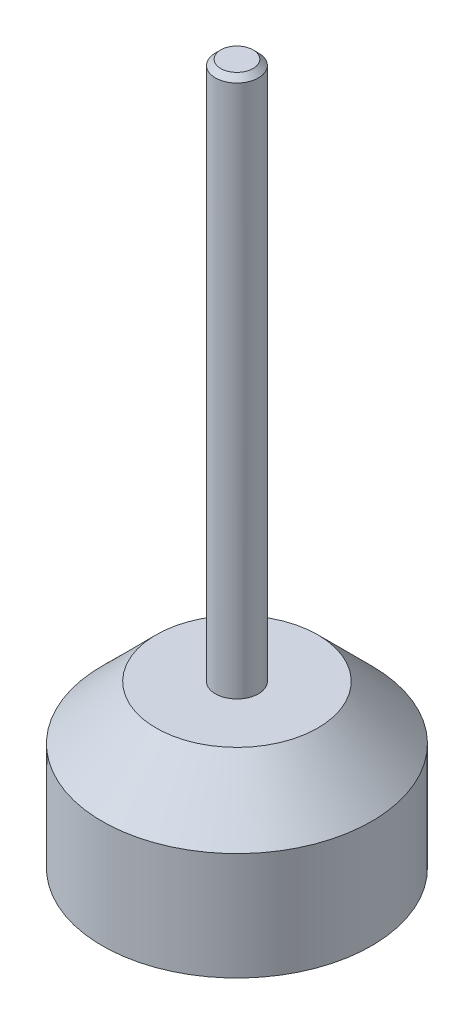
ISO-10303-21;
HEADER;
FILE_DESCRIPTION(('STEP AP214'),'2;1');
FILE_NAME('part.step','',(''),(''),'','','');
FILE_SCHEMA(('AUTOMOTIVE_DESIGN { 1 0 10303 214 1 1 1 1 }'));
ENDSEC;
DATA;
#1=APPLICATION_CONTEXT('core data for automotive mechanical design processes');
#2=APPLICATION_PROTOCOL_DEFINITION('international standard','automotive_design',2000,#1);
#3=PRODUCT_CONTEXT('',#1,'mechanical');
#4=PRODUCT('Part','Part','',(#3));
#5=PRODUCT_RELATED_PRODUCT_CATEGORY('part','',(#4));
#6=PRODUCT_DEFINITION_FORMATION('','',#4);
#7=PRODUCT_DEFINITION_CONTEXT('part definition',#1,'design');
#8=PRODUCT_DEFINITION('design','',#6,#7);
#9=PRODUCT_DEFINITION_SHAPE('','',#8);
#10=(LENGTH_UNIT() NAMED_UNIT(*) SI_UNIT(.MILLI.,.METRE.));
#11=(NAMED_UNIT(*) PLANE_ANGLE_UNIT() SI_UNIT($,.RADIAN.));
#12=(NAMED_UNIT(*) SI_UNIT($,.STERADIAN.) SOLID_ANGLE_UNIT());
#13=UNCERTAINTY_MEASURE_WITH_UNIT(LENGTH_MEASURE(1.E-05),#10,'distance_accuracy_value','');
#14=(GEOMETRIC_REPRESENTATION_CONTEXT(3) GLOBAL_UNCERTAINTY_ASSIGNED_CONTEXT((#13)) GLOBAL_UNIT_ASSIGNED_CONTEXT((#10,
#11,#12)) REPRESENTATION_CONTEXT('',''));
#15=CARTESIAN_POINT('',(0.,0.,0.));
#16=DIRECTION('',(0.,0.,1.));
#17=DIRECTION('',(1.,0.,0.));
#18=AXIS2_PLACEMENT_3D('',#15,#16,#17);
#19=CARTESIAN_POINT('',(0.,0.,0.));
#20=DIRECTION('',(0.,-1.,0.));
#21=DIRECTION('',(0.,0.,-1.));
#22=AXIS2_PLACEMENT_3D('',#19,#20,#21);
#23=PLANE('',#22);
#24=CARTESIAN_POINT('',(0.,0.,0.));
#25=DIRECTION('',(0.,-1.,0.));
#26=DIRECTION('',(0.,0.,-1.));
#27=AXIS2_PLACEMENT_3D('',#24,#25,#26);
#28=CIRCLE('',#27,25.);
#29=CARTESIAN_POINT('',(0.,0.,-25.));
#30=VERTEX_POINT('',#29);
#31=EDGE_CURVE('E46',#30,#30,#28,.T.);
#32=ORIENTED_EDGE('',*,*,#31,.T.);
#33=EDGE_LOOP('',(#32));
#34=FACE_BOUND('',#33,.T.);
#35=ADVANCED_FACE('F35',(#34),#23,.T.);
#36=CARTESIAN_POINT('',(0.,0.,0.));
#37=DIRECTION('',(0.,-1.,0.));
#38=DIRECTION('',(0.,0.,-1.));
#39=AXIS2_PLACEMENT_3D('',#36,#37,#38);
#40=CYLINDRICAL_SURFACE('',#39,25.);
#41=CARTESIAN_POINT('',(0.,20.,0.));
#42=DIRECTION('',(0.,-1.,0.));
#43=DIRECTION('',(0.,0.,-1.));
#44=AXIS2_PLACEMENT_3D('',#41,#42,#43);
#45=CIRCLE('',#44,25.);
#46=CARTESIAN_POINT('',(0.,20.,-25.));
#47=VERTEX_POINT('',#46);
#48=EDGE_CURVE('E50',#47,#47,#45,.T.);
#49=ORIENTED_EDGE('',*,*,#48,.T.);
#50=EDGE_LOOP('',(#49));
#51=FACE_BOUND('',#50,.T.);
#52=ORIENTED_EDGE('',*,*,#31,.F.);
#53=EDGE_LOOP('',(#52));
#54=FACE_BOUND('',#53,.T.);
#55=ADVANCED_FACE('F77',(#51,#54),#40,.T.);
#56=CARTESIAN_POINT('',(0.,20.,0.));
#57=DIRECTION('',(0.,-1.,0.));
#58=DIRECTION('',(0.,0.,-1.));
#59=AXIS2_PLACEMENT_3D('',#56,#57,#58);
#60=CONICAL_SURFACE('',#59,25.,0.785398163397449);
#61=CARTESIAN_POINT('',(0.,30.,0.));
#62=DIRECTION('',(0.,-1.,0.));
#63=DIRECTION('',(0.,0.,-1.));
#64=AXIS2_PLACEMENT_3D('',#61,#62,#63);
#65=CIRCLE('',#64,15.);
#66=CARTESIAN_POINT('',(0.,30.,-15.));
#67=VERTEX_POINT('',#66);
#68=EDGE_CURVE('E55',#67,#67,#65,.T.);
#69=ORIENTED_EDGE('',*,*,#68,.T.);
#70=EDGE_LOOP('',(#69));
#71=FACE_BOUND('',#70,.T.);
#72=ORIENTED_EDGE('',*,*,#48,.F.);
#73=EDGE_LOOP('',(#72));
#74=FACE_BOUND('',#73,.T.);
#75=ADVANCED_FACE('F74',(#71,#74),#60,.T.);
#76=CARTESIAN_POINT('',(15.,30.,0.));
#77=DIRECTION('',(0.,1.,0.));
#78=DIRECTION('',(0.,0.,1.));
#79=AXIS2_PLACEMENT_3D('',#76,#77,#78);
#80=PLANE('',#79);
#81=CARTESIAN_POINT('',(0.,30.,0.));
#82=DIRECTION('',(0.,-1.,0.));
#83=DIRECTION('',(0.,0.,-1.));
#84=AXIS2_PLACEMENT_3D('',#81,#82,#83);
#85=CIRCLE('',#84,4.);
#86=CARTESIAN_POINT('',(0.,30.,-4.));
#87=VERTEX_POINT('',#86);
#88=EDGE_CURVE('E58',#87,#87,#85,.T.);
#89=ORIENTED_EDGE('',*,*,#88,.T.);
#90=EDGE_LOOP('',(#89));
#91=FACE_BOUND('',#90,.T.);
#92=ORIENTED_EDGE('',*,*,#68,.F.);
#93=EDGE_LOOP('',(#92));
#94=FACE_BOUND('',#93,.T.);
#95=ADVANCED_FACE('F62',(#91,#94),#80,.T.);
#96=CARTESIAN_POINT('',(0.,0.,0.));
#97=DIRECTION('',(0.,-1.,0.));
#98=DIRECTION('',(0.,0.,-1.));
#99=AXIS2_PLACEMENT_3D('',#96,#97,#98);
#100=CYLINDRICAL_SURFACE('',#99,4.);
#101=CARTESIAN_POINT('',(0.,129.,0.));
#102=DIRECTION('',(0.,1.,0.));
#103=DIRECTION('',(0.,0.,1.));
#104=AXIS2_PLACEMENT_3D('',#101,#102,#103);
#105=CIRCLE('',#104,4.);
#106=CARTESIAN_POINT('',(0.,129.,4.));
#107=VERTEX_POINT('',#106);
#108=EDGE_CURVE('E42',#107,#107,#105,.F.);
#109=ORIENTED_EDGE('',*,*,#108,.T.);
#110=EDGE_LOOP('',(#109));
#111=FACE_BOUND('',#110,.T.);
#112=ORIENTED_EDGE('',*,*,#88,.F.);
#113=EDGE_LOOP('',(#112));
#114=FACE_BOUND('',#113,.T.);
#115=ADVANCED_FACE('F65',(#111,#114),#100,.T.);
#116=CARTESIAN_POINT('',(4.,130.,0.));
#117=DIRECTION('',(0.,1.,0.));
#118=DIRECTION('',(0.,0.,1.));
#119=AXIS2_PLACEMENT_3D('',#116,#117,#118);
#120=PLANE('',#119);
#121=CARTESIAN_POINT('',(0.,130.,0.));
#122=DIRECTION('',(0.,1.,0.));
#123=DIRECTION('',(0.,0.,1.));
#124=AXIS2_PLACEMENT_3D('',#121,#122,#123);
#125=CIRCLE('',#124,3.00000000000002);
#126=CARTESIAN_POINT('',(0.,130.,3.00000000000002));
#127=VERTEX_POINT('',#126);
#128=EDGE_CURVE('E10',#127,#127,#125,.T.);
#129=ORIENTED_EDGE('',*,*,#128,.T.);
#130=EDGE_LOOP('',(#129));
#131=FACE_BOUND('',#130,.T.);
#132=ADVANCED_FACE('F67',(#131),#120,.T.);
#133=CARTESIAN_POINT('',(0.,129.,0.));
#134=DIRECTION('',(0.,-1.,0.));
#135=DIRECTION('',(0.,0.,-1.));
#136=AXIS2_PLACEMENT_3D('',#133,#134,#135);
#137=CONICAL_SURFACE('',#136,4.,0.78539816339744);
#138=ORIENTED_EDGE('',*,*,#128,.F.);
#139=EDGE_LOOP('',(#138));
#140=FACE_BOUND('',#139,.T.);
#141=ORIENTED_EDGE('',*,*,#108,.F.);
#142=EDGE_LOOP('',(#141));
#143=FACE_BOUND('',#142,.T.);
#144=ADVANCED_FACE('F37',(#140,#143),#137,.T.);
#145=CLOSED_SHELL('',(#35,#55,#75,#95,#115,#132,#144));
#146=MANIFOLD_SOLID_BREP('B2',#145);
#147=ADVANCED_BREP_SHAPE_REPRESENTATION('',(#18,#146),#14);
#148=SHAPE_DEFINITION_REPRESENTATION(#9,#147);
ENDSEC;
END-ISO-10303-21;
